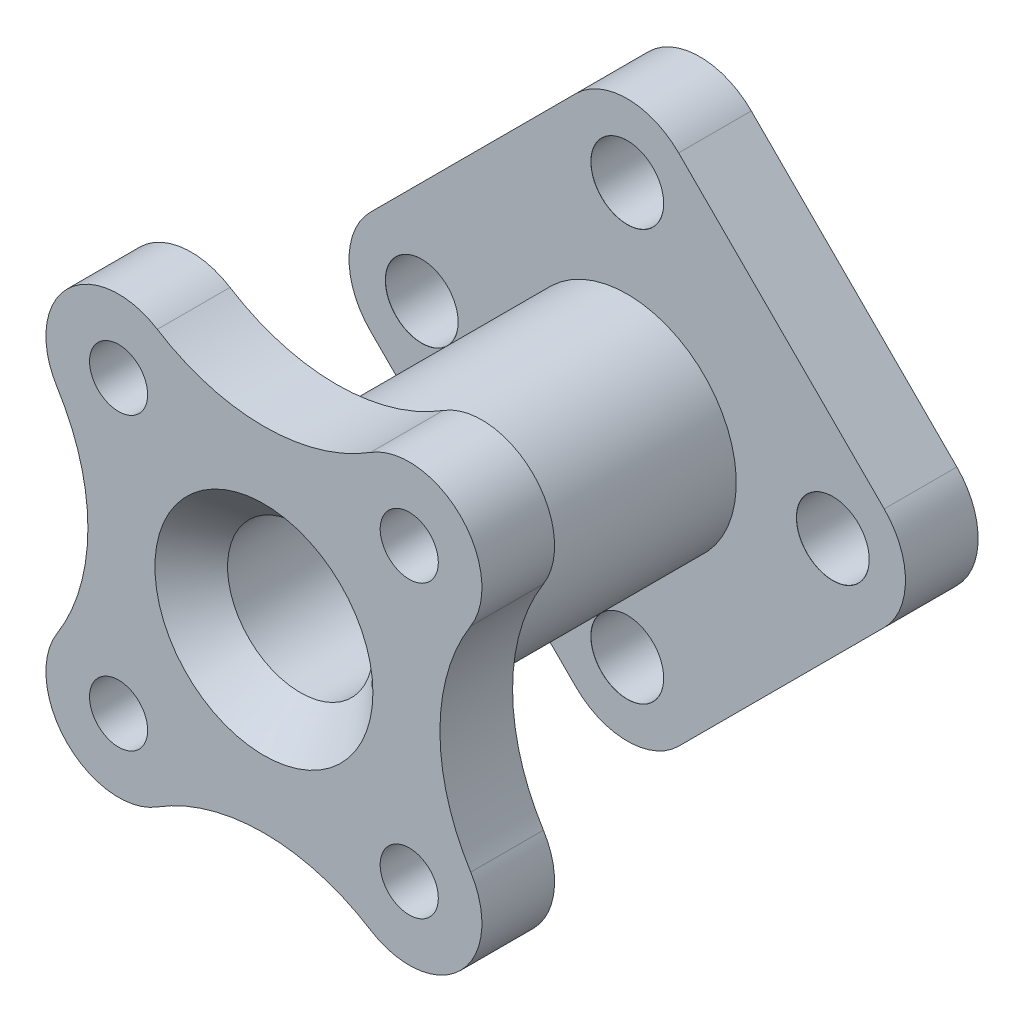
ISO-10303-21;
HEADER;
FILE_DESCRIPTION(('STEP AP214'),'2;1');
FILE_NAME('part.step','',(''),(''),'','','');
FILE_SCHEMA(('AUTOMOTIVE_DESIGN { 1 0 10303 214 1 1 1 1 }'));
ENDSEC;
DATA;
#1=APPLICATION_CONTEXT('core data for automotive mechanical design processes');
#2=APPLICATION_PROTOCOL_DEFINITION('international standard','automotive_design',2000,#1);
#3=PRODUCT_CONTEXT('',#1,'mechanical');
#4=PRODUCT('Part','Part','',(#3));
#5=PRODUCT_RELATED_PRODUCT_CATEGORY('part','',(#4));
#6=PRODUCT_DEFINITION_FORMATION('','',#4);
#7=PRODUCT_DEFINITION_CONTEXT('part definition',#1,'design');
#8=PRODUCT_DEFINITION('design','',#6,#7);
#9=PRODUCT_DEFINITION_SHAPE('','',#8);
#10=(LENGTH_UNIT() NAMED_UNIT(*) SI_UNIT(.MILLI.,.METRE.));
#11=(NAMED_UNIT(*) PLANE_ANGLE_UNIT() SI_UNIT($,.RADIAN.));
#12=(NAMED_UNIT(*) SI_UNIT($,.STERADIAN.) SOLID_ANGLE_UNIT());
#13=UNCERTAINTY_MEASURE_WITH_UNIT(LENGTH_MEASURE(1.E-05),#10,'distance_accuracy_value','');
#14=(GEOMETRIC_REPRESENTATION_CONTEXT(3) GLOBAL_UNCERTAINTY_ASSIGNED_CONTEXT((#13)) GLOBAL_UNIT_ASSIGNED_CONTEXT((#10,
#11,#12)) REPRESENTATION_CONTEXT('',''));
#15=CARTESIAN_POINT('',(0.,0.,0.));
#16=DIRECTION('',(0.,0.,1.));
#17=DIRECTION('',(1.,0.,0.));
#18=AXIS2_PLACEMENT_3D('',#15,#16,#17);
#19=CARTESIAN_POINT('',(0.,0.,20.));
#20=DIRECTION('',(0.,0.,1.));
#21=DIRECTION('',(1.,0.,0.));
#22=AXIS2_PLACEMENT_3D('',#19,#20,#21);
#23=PLANE('',#22);
#24=CARTESIAN_POINT('',(0.,0.,20.));
#25=DIRECTION('',(0.,0.,-1.));
#26=DIRECTION('',(1.,0.,0.));
#27=AXIS2_PLACEMENT_3D('',#24,#25,#26);
#28=CIRCLE('',#27,20.);
#29=CARTESIAN_POINT('',(-20.,0.,20.));
#30=VERTEX_POINT('',#29);
#31=EDGE_CURVE('E212',#30,#30,#28,.T.);
#32=ORIENTED_EDGE('',*,*,#31,.F.);
#33=EDGE_LOOP('',(#32));
#34=FACE_BOUND('',#33,.T.);
#35=ADVANCED_FACE('F14',(#34),#23,.T.);
#36=CARTESIAN_POINT('',(0.,56.5685424949238,20.));
#37=DIRECTION('',(0.,0.,1.));
#38=DIRECTION('',(-1.,0.,0.));
#39=AXIS2_PLACEMENT_3D('',#36,#37,#38);
#40=CYLINDRICAL_SURFACE('',#39,20.);
#41=CARTESIAN_POINT('',(0.,56.5685424949238,20.));
#42=DIRECTION('',(0.,0.,1.));
#43=DIRECTION('',(1.,0.,0.));
#44=AXIS2_PLACEMENT_3D('',#41,#42,#43);
#45=CIRCLE('',#44,20.);
#46=CARTESIAN_POINT('',(14.1421356237309,70.7106781186548,20.));
#47=VERTEX_POINT('',#46);
#48=CARTESIAN_POINT('',(-14.142135623731,70.7106781186548,20.));
#49=VERTEX_POINT('',#48);
#50=EDGE_CURVE('E199',#47,#49,#45,.T.);
#51=ORIENTED_EDGE('',*,*,#50,.F.);
#52=DIRECTION('',(0.,0.,1.));
#53=VECTOR('',#52,1.);
#54=CARTESIAN_POINT('',(14.1421356237309,70.7106781186548,20.));
#55=LINE('',#54,#53);
#56=CARTESIAN_POINT('',(14.1421356237309,70.7106781186548,0.));
#57=VERTEX_POINT('',#56);
#58=EDGE_CURVE('E228',#57,#47,#55,.T.);
#59=ORIENTED_EDGE('',*,*,#58,.F.);
#60=CARTESIAN_POINT('',(0.,56.5685424949238,0.));
#61=DIRECTION('',(0.,0.,-1.));
#62=DIRECTION('',(1.,0.,0.));
#63=AXIS2_PLACEMENT_3D('',#60,#61,#62);
#64=CIRCLE('',#63,20.);
#65=CARTESIAN_POINT('',(-14.142135623731,70.7106781186548,0.));
#66=VERTEX_POINT('',#65);
#67=EDGE_CURVE('E204',#66,#57,#64,.T.);
#68=ORIENTED_EDGE('',*,*,#67,.F.);
#69=DIRECTION('',(0.,0.,-1.));
#70=VECTOR('',#69,1.);
#71=CARTESIAN_POINT('',(-14.142135623731,70.7106781186548,20.));
#72=LINE('',#71,#70);
#73=EDGE_CURVE('E254',#49,#66,#72,.T.);
#74=ORIENTED_EDGE('',*,*,#73,.F.);
#75=EDGE_LOOP('',(#51,#59,#68,#74));
#76=FACE_BOUND('',#75,.T.);
#77=ADVANCED_FACE('F416',(#76),#40,.T.);
#78=CARTESIAN_POINT('',(0.,-56.5685424949238,20.));
#79=DIRECTION('',(0.,0.,1.));
#80=DIRECTION('',(-1.,0.,0.));
#81=AXIS2_PLACEMENT_3D('',#78,#79,#80);
#82=CYLINDRICAL_SURFACE('',#81,20.);
#83=CARTESIAN_POINT('',(0.,-56.5685424949238,20.));
#84=DIRECTION('',(0.,0.,1.));
#85=DIRECTION('',(1.,0.,0.));
#86=AXIS2_PLACEMENT_3D('',#83,#84,#85);
#87=CIRCLE('',#86,20.);
#88=CARTESIAN_POINT('',(-14.1421356237309,-70.7106781186548,20.));
#89=VERTEX_POINT('',#88);
#90=CARTESIAN_POINT('',(14.142135623731,-70.7106781186548,20.));
#91=VERTEX_POINT('',#90);
#92=EDGE_CURVE('E202',#89,#91,#87,.T.);
#93=ORIENTED_EDGE('',*,*,#92,.F.);
#94=DIRECTION('',(0.,0.,1.));
#95=VECTOR('',#94,1.);
#96=CARTESIAN_POINT('',(-14.1421356237309,-70.7106781186548,20.));
#97=LINE('',#96,#95);
#98=CARTESIAN_POINT('',(-14.1421356237309,-70.7106781186548,0.));
#99=VERTEX_POINT('',#98);
#100=EDGE_CURVE('E272',#99,#89,#97,.T.);
#101=ORIENTED_EDGE('',*,*,#100,.F.);
#102=CARTESIAN_POINT('',(0.,-56.5685424949238,0.));
#103=DIRECTION('',(0.,0.,-1.));
#104=DIRECTION('',(1.,0.,0.));
#105=AXIS2_PLACEMENT_3D('',#102,#103,#104);
#106=CIRCLE('',#105,20.);
#107=CARTESIAN_POINT('',(14.142135623731,-70.7106781186548,0.));
#108=VERTEX_POINT('',#107);
#109=EDGE_CURVE('E207',#108,#99,#106,.T.);
#110=ORIENTED_EDGE('',*,*,#109,.F.);
#111=DIRECTION('',(0.,0.,-1.));
#112=VECTOR('',#111,1.);
#113=CARTESIAN_POINT('',(14.142135623731,-70.7106781186548,20.));
#114=LINE('',#113,#112);
#115=EDGE_CURVE('E280',#91,#108,#114,.T.);
#116=ORIENTED_EDGE('',*,*,#115,.F.);
#117=EDGE_LOOP('',(#93,#101,#110,#116));
#118=FACE_BOUND('',#117,.T.);
#119=ADVANCED_FACE('F332',(#118),#82,.T.);
#120=CARTESIAN_POINT('',(56.5685424949238,0.,20.));
#121=DIRECTION('',(0.,0.,1.));
#122=DIRECTION('',(-1.,0.,0.));
#123=AXIS2_PLACEMENT_3D('',#120,#121,#122);
#124=CYLINDRICAL_SURFACE('',#123,20.);
#125=CARTESIAN_POINT('',(56.5685424949238,0.,20.));
#126=DIRECTION('',(0.,0.,1.));
#127=DIRECTION('',(1.,0.,0.));
#128=AXIS2_PLACEMENT_3D('',#125,#126,#127);
#129=CIRCLE('',#128,20.);
#130=CARTESIAN_POINT('',(70.7106781186548,-14.142135623731,20.));
#131=VERTEX_POINT('',#130);
#132=CARTESIAN_POINT('',(70.7106781186548,14.1421356237309,20.));
#133=VERTEX_POINT('',#132);
#134=EDGE_CURVE('E203',#131,#133,#129,.T.);
#135=ORIENTED_EDGE('',*,*,#134,.F.);
#136=DIRECTION('',(0.,0.,1.));
#137=VECTOR('',#136,1.);
#138=CARTESIAN_POINT('',(70.7106781186548,-14.142135623731,20.));
#139=LINE('',#138,#137);
#140=CARTESIAN_POINT('',(70.7106781186548,-14.142135623731,0.));
#141=VERTEX_POINT('',#140);
#142=EDGE_CURVE('E221',#141,#131,#139,.T.);
#143=ORIENTED_EDGE('',*,*,#142,.F.);
#144=CARTESIAN_POINT('',(56.5685424949238,0.,0.));
#145=DIRECTION('',(0.,0.,-1.));
#146=DIRECTION('',(1.,0.,0.));
#147=AXIS2_PLACEMENT_3D('',#144,#145,#146);
#148=CIRCLE('',#147,20.);
#149=CARTESIAN_POINT('',(70.7106781186548,14.1421356237309,0.));
#150=VERTEX_POINT('',#149);
#151=EDGE_CURVE('E241',#150,#141,#148,.T.);
#152=ORIENTED_EDGE('',*,*,#151,.F.);
#153=DIRECTION('',(0.,0.,-1.));
#154=VECTOR('',#153,1.);
#155=CARTESIAN_POINT('',(70.7106781186548,14.1421356237309,20.));
#156=LINE('',#155,#154);
#157=EDGE_CURVE('E268',#133,#150,#156,.T.);
#158=ORIENTED_EDGE('',*,*,#157,.F.);
#159=EDGE_LOOP('',(#135,#143,#152,#158));
#160=FACE_BOUND('',#159,.T.);
#161=ADVANCED_FACE('F441',(#160),#124,.T.);
#162=CARTESIAN_POINT('',(20.,71.7214438511238,100.));
#163=DIRECTION('',(0.,0.,1.));
#164=DIRECTION('',(1.,0.,0.));
#165=AXIS2_PLACEMENT_3D('',#162,#163,#164);
#166=PLANE('',#165);
#167=CARTESIAN_POINT('',(0.,103.442887702248,100.));
#168=DIRECTION('',(0.,0.,-1.));
#169=DIRECTION('',(1.,0.,0.));
#170=AXIS2_PLACEMENT_3D('',#167,#168,#169);
#171=CIRCLE('',#170,55.);
#172=CARTESIAN_POINT('',(29.3333333333333,56.918103387266,100.));
#173=VERTEX_POINT('',#172);
#174=CARTESIAN_POINT('',(-29.3333333333333,56.918103387266,100.));
#175=VERTEX_POINT('',#174);
#176=EDGE_CURVE('E206',#173,#175,#171,.T.);
#177=ORIENTED_EDGE('',*,*,#176,.F.);
#178=CARTESIAN_POINT('',(40.,40.,100.));
#179=DIRECTION('',(0.,0.,1.));
#180=DIRECTION('',(-1.,0.,0.));
#181=AXIS2_PLACEMENT_3D('',#178,#179,#180);
#182=CIRCLE('',#181,20.);
#183=CARTESIAN_POINT('',(56.918103387266,29.3333333333333,100.));
#184=VERTEX_POINT('',#183);
#185=EDGE_CURVE('E24',#184,#173,#182,.T.);
#186=ORIENTED_EDGE('',*,*,#185,.F.);
#187=CARTESIAN_POINT('',(103.442887702248,0.,100.));
#188=DIRECTION('',(0.,0.,-1.));
#189=DIRECTION('',(1.,0.,0.));
#190=AXIS2_PLACEMENT_3D('',#187,#188,#189);
#191=CIRCLE('',#190,55.);
#192=CARTESIAN_POINT('',(56.918103387266,-29.3333333333333,100.));
#193=VERTEX_POINT('',#192);
#194=EDGE_CURVE('E233',#193,#184,#191,.T.);
#195=ORIENTED_EDGE('',*,*,#194,.F.);
#196=CARTESIAN_POINT('',(40.,-40.,100.));
#197=DIRECTION('',(0.,0.,1.));
#198=DIRECTION('',(1.,0.,0.));
#199=AXIS2_PLACEMENT_3D('',#196,#197,#198);
#200=CIRCLE('',#199,20.);
#201=CARTESIAN_POINT('',(29.3333333333333,-56.918103387266,100.));
#202=VERTEX_POINT('',#201);
#203=EDGE_CURVE('E239',#202,#193,#200,.T.);
#204=ORIENTED_EDGE('',*,*,#203,.F.);
#205=CARTESIAN_POINT('',(0.,-103.442887702248,100.));
#206=DIRECTION('',(0.,0.,-1.));
#207=DIRECTION('',(-1.,0.,0.));
#208=AXIS2_PLACEMENT_3D('',#205,#206,#207);
#209=CIRCLE('',#208,55.);
#210=CARTESIAN_POINT('',(-29.3333333333333,-56.918103387266,100.));
#211=VERTEX_POINT('',#210);
#212=EDGE_CURVE('E102',#211,#202,#209,.T.);
#213=ORIENTED_EDGE('',*,*,#212,.F.);
#214=CARTESIAN_POINT('',(-40.,-40.,100.));
#215=DIRECTION('',(0.,0.,1.));
#216=DIRECTION('',(-1.,0.,0.));
#217=AXIS2_PLACEMENT_3D('',#214,#215,#216);
#218=CIRCLE('',#217,20.);
#219=CARTESIAN_POINT('',(-56.918103387266,-29.3333333333333,100.));
#220=VERTEX_POINT('',#219);
#221=EDGE_CURVE('E315',#220,#211,#218,.T.);
#222=ORIENTED_EDGE('',*,*,#221,.F.);
#223=CARTESIAN_POINT('',(-103.442887702248,0.,100.));
#224=DIRECTION('',(0.,0.,-1.));
#225=DIRECTION('',(-1.,0.,0.));
#226=AXIS2_PLACEMENT_3D('',#223,#224,#225);
#227=CIRCLE('',#226,55.);
#228=CARTESIAN_POINT('',(-56.918103387266,29.3333333333333,100.));
#229=VERTEX_POINT('',#228);
#230=EDGE_CURVE('E242',#229,#220,#227,.T.);
#231=ORIENTED_EDGE('',*,*,#230,.F.);
#232=CARTESIAN_POINT('',(-40.,40.,100.));
#233=DIRECTION('',(0.,0.,1.));
#234=DIRECTION('',(1.,0.,0.));
#235=AXIS2_PLACEMENT_3D('',#232,#233,#234);
#236=CIRCLE('',#235,20.);
#237=EDGE_CURVE('E293',#175,#229,#236,.T.);
#238=ORIENTED_EDGE('',*,*,#237,.F.);
#239=EDGE_LOOP('',(#177,#186,#195,#204,#213,#222,#231,#238));
#240=FACE_BOUND('',#239,.T.);
#241=CARTESIAN_POINT('',(0.,0.,100.));
#242=DIRECTION('',(0.,0.,1.));
#243=DIRECTION('',(1.,0.,0.));
#244=AXIS2_PLACEMENT_3D('',#241,#242,#243);
#245=CIRCLE('',#244,30.);
#246=CARTESIAN_POINT('',(-30.,0.,100.));
#247=VERTEX_POINT('',#246);
#248=EDGE_CURVE('E261',#247,#247,#245,.T.);
#249=ORIENTED_EDGE('',*,*,#248,.T.);
#250=EDGE_LOOP('',(#249));
#251=FACE_BOUND('',#250,.T.);
#252=CARTESIAN_POINT('',(40.,40.,100.));
#253=DIRECTION('',(0.,0.,1.));
#254=DIRECTION('',(1.,0.,0.));
#255=AXIS2_PLACEMENT_3D('',#252,#253,#254);
#256=CIRCLE('',#255,8.);
#257=CARTESIAN_POINT('',(48.,40.,100.));
#258=VERTEX_POINT('',#257);
#259=EDGE_CURVE('E363',#258,#258,#256,.T.);
#260=ORIENTED_EDGE('',*,*,#259,.T.);
#261=EDGE_LOOP('',(#260));
#262=FACE_BOUND('',#261,.T.);
#263=CARTESIAN_POINT('',(-40.,40.,100.));
#264=DIRECTION('',(0.,0.,1.));
#265=DIRECTION('',(1.,0.,0.));
#266=AXIS2_PLACEMENT_3D('',#263,#264,#265);
#267=CIRCLE('',#266,8.);
#268=CARTESIAN_POINT('',(-32.,40.,100.));
#269=VERTEX_POINT('',#268);
#270=EDGE_CURVE('E273',#269,#269,#267,.T.);
#271=ORIENTED_EDGE('',*,*,#270,.T.);
#272=EDGE_LOOP('',(#271));
#273=FACE_BOUND('',#272,.T.);
#274=CARTESIAN_POINT('',(-40.,-40.,100.));
#275=DIRECTION('',(0.,0.,1.));
#276=DIRECTION('',(1.,0.,0.));
#277=AXIS2_PLACEMENT_3D('',#274,#275,#276);
#278=CIRCLE('',#277,8.);
#279=CARTESIAN_POINT('',(-32.,-40.,100.));
#280=VERTEX_POINT('',#279);
#281=EDGE_CURVE('E285',#280,#280,#278,.T.);
#282=ORIENTED_EDGE('',*,*,#281,.T.);
#283=EDGE_LOOP('',(#282));
#284=FACE_BOUND('',#283,.T.);
#285=CARTESIAN_POINT('',(40.,-40.,100.));
#286=DIRECTION('',(0.,0.,1.));
#287=DIRECTION('',(1.,0.,0.));
#288=AXIS2_PLACEMENT_3D('',#285,#286,#287);
#289=CIRCLE('',#288,8.);
#290=CARTESIAN_POINT('',(48.,-40.,100.));
#291=VERTEX_POINT('',#290);
#292=EDGE_CURVE('E295',#291,#291,#289,.T.);
#293=ORIENTED_EDGE('',*,*,#292,.T.);
#294=EDGE_LOOP('',(#293));
#295=FACE_BOUND('',#294,.T.);
#296=ADVANCED_FACE('F437',(#240,#251,#262,#273,#284,#295),#166,.F.);
#297=CARTESIAN_POINT('',(20.,71.7214438511238,120.));
#298=DIRECTION('',(0.,0.,1.));
#299=DIRECTION('',(1.,0.,0.));
#300=AXIS2_PLACEMENT_3D('',#297,#298,#299);
#301=PLANE('',#300);
#302=CARTESIAN_POINT('',(0.,103.442887702248,120.));
#303=DIRECTION('',(0.,0.,-1.));
#304=DIRECTION('',(1.,0.,0.));
#305=AXIS2_PLACEMENT_3D('',#302,#303,#304);
#306=CIRCLE('',#305,55.);
#307=CARTESIAN_POINT('',(29.3333333333333,56.918103387266,120.));
#308=VERTEX_POINT('',#307);
#309=CARTESIAN_POINT('',(-29.3333333333333,56.918103387266,120.));
#310=VERTEX_POINT('',#309);
#311=EDGE_CURVE('E91',#308,#310,#306,.T.);
#312=ORIENTED_EDGE('',*,*,#311,.T.);
#313=CARTESIAN_POINT('',(-40.,40.,120.));
#314=DIRECTION('',(0.,0.,1.));
#315=DIRECTION('',(1.,0.,0.));
#316=AXIS2_PLACEMENT_3D('',#313,#314,#315);
#317=CIRCLE('',#316,20.);
#318=CARTESIAN_POINT('',(-56.918103387266,29.3333333333333,120.));
#319=VERTEX_POINT('',#318);
#320=EDGE_CURVE('E255',#310,#319,#317,.T.);
#321=ORIENTED_EDGE('',*,*,#320,.T.);
#322=CARTESIAN_POINT('',(-103.442887702248,0.,120.));
#323=DIRECTION('',(0.,0.,-1.));
#324=DIRECTION('',(-1.,0.,0.));
#325=AXIS2_PLACEMENT_3D('',#322,#323,#324);
#326=CIRCLE('',#325,55.);
#327=CARTESIAN_POINT('',(-56.918103387266,-29.3333333333333,120.));
#328=VERTEX_POINT('',#327);
#329=EDGE_CURVE('E244',#319,#328,#326,.T.);
#330=ORIENTED_EDGE('',*,*,#329,.T.);
#331=CARTESIAN_POINT('',(-40.,-40.,120.));
#332=DIRECTION('',(0.,0.,1.));
#333=DIRECTION('',(-1.,0.,0.));
#334=AXIS2_PLACEMENT_3D('',#331,#332,#333);
#335=CIRCLE('',#334,20.);
#336=CARTESIAN_POINT('',(-29.3333333333333,-56.918103387266,120.));
#337=VERTEX_POINT('',#336);
#338=EDGE_CURVE('E299',#328,#337,#335,.T.);
#339=ORIENTED_EDGE('',*,*,#338,.T.);
#340=CARTESIAN_POINT('',(0.,-103.442887702248,120.));
#341=DIRECTION('',(0.,0.,-1.));
#342=DIRECTION('',(-1.,0.,0.));
#343=AXIS2_PLACEMENT_3D('',#340,#341,#342);
#344=CIRCLE('',#343,55.);
#345=CARTESIAN_POINT('',(29.3333333333333,-56.918103387266,120.));
#346=VERTEX_POINT('',#345);
#347=EDGE_CURVE('E288',#337,#346,#344,.T.);
#348=ORIENTED_EDGE('',*,*,#347,.T.);
#349=CARTESIAN_POINT('',(40.,-40.,120.));
#350=DIRECTION('',(0.,0.,1.));
#351=DIRECTION('',(1.,0.,0.));
#352=AXIS2_PLACEMENT_3D('',#349,#350,#351);
#353=CIRCLE('',#352,20.);
#354=CARTESIAN_POINT('',(56.918103387266,-29.3333333333333,120.));
#355=VERTEX_POINT('',#354);
#356=EDGE_CURVE('E33',#346,#355,#353,.T.);
#357=ORIENTED_EDGE('',*,*,#356,.T.);
#358=CARTESIAN_POINT('',(103.442887702248,0.,120.));
#359=DIRECTION('',(0.,0.,-1.));
#360=DIRECTION('',(1.,0.,0.));
#361=AXIS2_PLACEMENT_3D('',#358,#359,#360);
#362=CIRCLE('',#361,55.);
#363=CARTESIAN_POINT('',(56.918103387266,29.3333333333333,120.));
#364=VERTEX_POINT('',#363);
#365=EDGE_CURVE('E18',#355,#364,#362,.T.);
#366=ORIENTED_EDGE('',*,*,#365,.T.);
#367=CARTESIAN_POINT('',(40.,40.,120.));
#368=DIRECTION('',(0.,0.,1.));
#369=DIRECTION('',(-1.,0.,0.));
#370=AXIS2_PLACEMENT_3D('',#367,#368,#369);
#371=CIRCLE('',#370,20.);
#372=EDGE_CURVE('E9',#364,#308,#371,.T.);
#373=ORIENTED_EDGE('',*,*,#372,.T.);
#374=EDGE_LOOP('',(#312,#321,#330,#339,#348,#357,#366,#373));
#375=FACE_BOUND('',#374,.T.);
#376=CARTESIAN_POINT('',(40.,40.,120.));
#377=DIRECTION('',(0.,0.,1.));
#378=DIRECTION('',(1.,0.,0.));
#379=AXIS2_PLACEMENT_3D('',#376,#377,#378);
#380=CIRCLE('',#379,8.);
#381=CARTESIAN_POINT('',(48.,40.,120.));
#382=VERTEX_POINT('',#381);
#383=EDGE_CURVE('E275',#382,#382,#380,.T.);
#384=ORIENTED_EDGE('',*,*,#383,.F.);
#385=EDGE_LOOP('',(#384));
#386=FACE_BOUND('',#385,.T.);
#387=CARTESIAN_POINT('',(-40.,40.,120.));
#388=DIRECTION('',(0.,0.,1.));
#389=DIRECTION('',(1.,0.,0.));
#390=AXIS2_PLACEMENT_3D('',#387,#388,#389);
#391=CIRCLE('',#390,8.);
#392=CARTESIAN_POINT('',(-32.,40.,120.));
#393=VERTEX_POINT('',#392);
#394=EDGE_CURVE('E276',#393,#393,#391,.T.);
#395=ORIENTED_EDGE('',*,*,#394,.F.);
#396=EDGE_LOOP('',(#395));
#397=FACE_BOUND('',#396,.T.);
#398=CARTESIAN_POINT('',(-40.,-40.,120.));
#399=DIRECTION('',(0.,0.,1.));
#400=DIRECTION('',(1.,0.,0.));
#401=AXIS2_PLACEMENT_3D('',#398,#399,#400);
#402=CIRCLE('',#401,8.);
#403=CARTESIAN_POINT('',(-32.,-40.,120.));
#404=VERTEX_POINT('',#403);
#405=EDGE_CURVE('E297',#404,#404,#402,.T.);
#406=ORIENTED_EDGE('',*,*,#405,.F.);
#407=EDGE_LOOP('',(#406));
#408=FACE_BOUND('',#407,.T.);
#409=CARTESIAN_POINT('',(40.,-40.,120.));
#410=DIRECTION('',(0.,0.,1.));
#411=DIRECTION('',(1.,0.,0.));
#412=AXIS2_PLACEMENT_3D('',#409,#410,#411);
#413=CIRCLE('',#412,8.);
#414=CARTESIAN_POINT('',(48.,-40.,120.));
#415=VERTEX_POINT('',#414);
#416=EDGE_CURVE('E226',#415,#415,#413,.T.);
#417=ORIENTED_EDGE('',*,*,#416,.F.);
#418=EDGE_LOOP('',(#417));
#419=FACE_BOUND('',#418,.T.);
#420=CARTESIAN_POINT('',(0.,0.,120.));
#421=DIRECTION('',(0.,0.,-1.));
#422=DIRECTION('',(1.,0.,0.));
#423=AXIS2_PLACEMENT_3D('',#420,#421,#422);
#424=CIRCLE('',#423,30.);
#425=CARTESIAN_POINT('',(30.,0.,120.));
#426=VERTEX_POINT('',#425);
#427=EDGE_CURVE('E213',#426,#426,#424,.T.);
#428=ORIENTED_EDGE('',*,*,#427,.T.);
#429=EDGE_LOOP('',(#428));
#430=FACE_BOUND('',#429,.T.);
#431=ADVANCED_FACE('F440',(#375,#386,#397,#408,#419,#430),#301,.T.);
#432=CARTESIAN_POINT('',(40.,40.,120.));
#433=DIRECTION('',(0.,0.,1.));
#434=DIRECTION('',(-1.,0.,0.));
#435=AXIS2_PLACEMENT_3D('',#432,#433,#434);
#436=CYLINDRICAL_SURFACE('',#435,20.);
#437=ORIENTED_EDGE('',*,*,#185,.T.);
#438=DIRECTION('',(0.,0.,-1.));
#439=VECTOR('',#438,1.);
#440=CARTESIAN_POINT('',(29.3333333333333,56.918103387266,120.));
#441=LINE('',#440,#439);
#442=EDGE_CURVE('E209',#308,#173,#441,.T.);
#443=ORIENTED_EDGE('',*,*,#442,.F.);
#444=ORIENTED_EDGE('',*,*,#372,.F.);
#445=DIRECTION('',(0.,0.,-1.));
#446=VECTOR('',#445,1.);
#447=CARTESIAN_POINT('',(56.918103387266,29.3333333333333,120.));
#448=LINE('',#447,#446);
#449=EDGE_CURVE('E236',#364,#184,#448,.T.);
#450=ORIENTED_EDGE('',*,*,#449,.T.);
#451=EDGE_LOOP('',(#437,#443,#444,#450));
#452=FACE_BOUND('',#451,.T.);
#453=ADVANCED_FACE('F16',(#452),#436,.T.);
#454=CARTESIAN_POINT('',(40.,-40.,120.));
#455=DIRECTION('',(0.,0.,1.));
#456=DIRECTION('',(-1.,0.,0.));
#457=AXIS2_PLACEMENT_3D('',#454,#455,#456);
#458=CYLINDRICAL_SURFACE('',#457,20.);
#459=ORIENTED_EDGE('',*,*,#203,.T.);
#460=DIRECTION('',(0.,0.,-1.));
#461=VECTOR('',#460,1.);
#462=CARTESIAN_POINT('',(56.918103387266,-29.3333333333333,120.));
#463=LINE('',#462,#461);
#464=EDGE_CURVE('E237',#355,#193,#463,.T.);
#465=ORIENTED_EDGE('',*,*,#464,.F.);
#466=ORIENTED_EDGE('',*,*,#356,.F.);
#467=DIRECTION('',(0.,0.,-1.));
#468=VECTOR('',#467,1.);
#469=CARTESIAN_POINT('',(29.3333333333333,-56.918103387266,120.));
#470=LINE('',#469,#468);
#471=EDGE_CURVE('E290',#346,#202,#470,.T.);
#472=ORIENTED_EDGE('',*,*,#471,.T.);
#473=EDGE_LOOP('',(#459,#465,#466,#472));
#474=FACE_BOUND('',#473,.T.);
#475=ADVANCED_FACE('F429',(#474),#458,.T.);
#476=CARTESIAN_POINT('',(0.,-103.442887702248,120.));
#477=DIRECTION('',(0.,0.,1.));
#478=DIRECTION('',(-1.,0.,0.));
#479=AXIS2_PLACEMENT_3D('',#476,#477,#478);
#480=CYLINDRICAL_SURFACE('',#479,55.);
#481=ORIENTED_EDGE('',*,*,#212,.T.);
#482=ORIENTED_EDGE('',*,*,#471,.F.);
#483=ORIENTED_EDGE('',*,*,#347,.F.);
#484=DIRECTION('',(0.,0.,-1.));
#485=VECTOR('',#484,1.);
#486=CARTESIAN_POINT('',(-29.3333333333333,-56.918103387266,120.));
#487=LINE('',#486,#485);
#488=EDGE_CURVE('E258',#337,#211,#487,.T.);
#489=ORIENTED_EDGE('',*,*,#488,.T.);
#490=EDGE_LOOP('',(#481,#482,#483,#489));
#491=FACE_BOUND('',#490,.T.);
#492=ADVANCED_FACE('F427',(#491),#480,.F.);
#493=CARTESIAN_POINT('',(-103.442887702248,0.,120.));
#494=DIRECTION('',(0.,0.,1.));
#495=DIRECTION('',(-1.,0.,0.));
#496=AXIS2_PLACEMENT_3D('',#493,#494,#495);
#497=CYLINDRICAL_SURFACE('',#496,55.);
#498=ORIENTED_EDGE('',*,*,#230,.T.);
#499=DIRECTION('',(0.,0.,-1.));
#500=VECTOR('',#499,1.);
#501=CARTESIAN_POINT('',(-56.918103387266,-29.3333333333333,120.));
#502=LINE('',#501,#500);
#503=EDGE_CURVE('E302',#328,#220,#502,.T.);
#504=ORIENTED_EDGE('',*,*,#503,.F.);
#505=ORIENTED_EDGE('',*,*,#329,.F.);
#506=DIRECTION('',(0.,0.,-1.));
#507=VECTOR('',#506,1.);
#508=CARTESIAN_POINT('',(-56.918103387266,29.3333333333333,120.));
#509=LINE('',#508,#507);
#510=EDGE_CURVE('E262',#319,#229,#509,.T.);
#511=ORIENTED_EDGE('',*,*,#510,.T.);
#512=EDGE_LOOP('',(#498,#504,#505,#511));
#513=FACE_BOUND('',#512,.T.);
#514=ADVANCED_FACE('F382',(#513),#497,.F.);
#515=CARTESIAN_POINT('',(0.,103.442887702248,120.));
#516=DIRECTION('',(0.,0.,1.));
#517=DIRECTION('',(-1.,0.,0.));
#518=AXIS2_PLACEMENT_3D('',#515,#516,#517);
#519=CYLINDRICAL_SURFACE('',#518,55.);
#520=ORIENTED_EDGE('',*,*,#176,.T.);
#521=DIRECTION('',(0.,0.,-1.));
#522=VECTOR('',#521,1.);
#523=CARTESIAN_POINT('',(-29.3333333333333,56.918103387266,120.));
#524=LINE('',#523,#522);
#525=EDGE_CURVE('E257',#310,#175,#524,.T.);
#526=ORIENTED_EDGE('',*,*,#525,.F.);
#527=ORIENTED_EDGE('',*,*,#311,.F.);
#528=ORIENTED_EDGE('',*,*,#442,.T.);
#529=EDGE_LOOP('',(#520,#526,#527,#528));
#530=FACE_BOUND('',#529,.T.);
#531=ADVANCED_FACE('F410',(#530),#519,.F.);
#532=CARTESIAN_POINT('',(0.,0.,0.));
#533=DIRECTION('',(0.,0.,1.));
#534=DIRECTION('',(1.,0.,0.));
#535=AXIS2_PLACEMENT_3D('',#532,#533,#534);
#536=PLANE('',#535);
#537=DIRECTION('',(-0.707106781186548,0.707106781186548,0.));
#538=VECTOR('',#537,1.);
#539=CARTESIAN_POINT('',(84.8528137423857,0.,0.));
#540=LINE('',#539,#538);
#541=EDGE_CURVE('E232',#150,#57,#540,.T.);
#542=ORIENTED_EDGE('',*,*,#541,.F.);
#543=ORIENTED_EDGE('',*,*,#151,.T.);
#544=DIRECTION('',(0.707106781186547,0.707106781186548,0.));
#545=VECTOR('',#544,1.);
#546=CARTESIAN_POINT('',(0.,-84.8528137423857,0.));
#547=LINE('',#546,#545);
#548=EDGE_CURVE('E218',#108,#141,#547,.T.);
#549=ORIENTED_EDGE('',*,*,#548,.F.);
#550=ORIENTED_EDGE('',*,*,#109,.T.);
#551=DIRECTION('',(0.707106781186548,-0.707106781186548,0.));
#552=VECTOR('',#551,1.);
#553=CARTESIAN_POINT('',(-84.8528137423857,0.,0.));
#554=LINE('',#553,#552);
#555=CARTESIAN_POINT('',(-70.7106781186548,-14.142135623731,0.));
#556=VERTEX_POINT('',#555);
#557=EDGE_CURVE('E269',#556,#99,#554,.T.);
#558=ORIENTED_EDGE('',*,*,#557,.F.);
#559=CARTESIAN_POINT('',(-56.5685424949238,0.,0.));
#560=DIRECTION('',(0.,0.,-1.));
#561=DIRECTION('',(1.,0.,0.));
#562=AXIS2_PLACEMENT_3D('',#559,#560,#561);
#563=CIRCLE('',#562,20.);
#564=CARTESIAN_POINT('',(-70.7106781186548,14.1421356237309,0.));
#565=VERTEX_POINT('',#564);
#566=EDGE_CURVE('E227',#556,#565,#563,.T.);
#567=ORIENTED_EDGE('',*,*,#566,.T.);
#568=DIRECTION('',(-0.707106781186547,-0.707106781186548,0.));
#569=VECTOR('',#568,1.);
#570=CARTESIAN_POINT('',(0.,84.8528137423857,0.));
#571=LINE('',#570,#569);
#572=EDGE_CURVE('E231',#66,#565,#571,.T.);
#573=ORIENTED_EDGE('',*,*,#572,.F.);
#574=ORIENTED_EDGE('',*,*,#67,.T.);
#575=EDGE_LOOP('',(#542,#543,#549,#550,#558,#567,#573,#574));
#576=FACE_BOUND('',#575,.T.);
#577=CARTESIAN_POINT('',(-56.5685424949238,0.,0.));
#578=DIRECTION('',(0.,0.,1.));
#579=DIRECTION('',(1.,0.,0.));
#580=AXIS2_PLACEMENT_3D('',#577,#578,#579);
#581=CIRCLE('',#580,10.);
#582=CARTESIAN_POINT('',(-46.5685424949238,0.,0.));
#583=VERTEX_POINT('',#582);
#584=EDGE_CURVE('E214',#583,#583,#581,.T.);
#585=ORIENTED_EDGE('',*,*,#584,.T.);
#586=EDGE_LOOP('',(#585));
#587=FACE_BOUND('',#586,.T.);
#588=CARTESIAN_POINT('',(0.,-56.5685424949238,0.));
#589=DIRECTION('',(0.,0.,1.));
#590=DIRECTION('',(1.,0.,0.));
#591=AXIS2_PLACEMENT_3D('',#588,#589,#590);
#592=CIRCLE('',#591,10.);
#593=CARTESIAN_POINT('',(10.,-56.5685424949238,0.));
#594=VERTEX_POINT('',#593);
#595=EDGE_CURVE('E190',#594,#594,#592,.T.);
#596=ORIENTED_EDGE('',*,*,#595,.T.);
#597=EDGE_LOOP('',(#596));
#598=FACE_BOUND('',#597,.T.);
#599=CARTESIAN_POINT('',(56.5685424949238,0.,0.));
#600=DIRECTION('',(0.,0.,1.));
#601=DIRECTION('',(1.,0.,0.));
#602=AXIS2_PLACEMENT_3D('',#599,#600,#601);
#603=CIRCLE('',#602,10.);
#604=CARTESIAN_POINT('',(66.5685424949238,0.,0.));
#605=VERTEX_POINT('',#604);
#606=EDGE_CURVE('E195',#605,#605,#603,.T.);
#607=ORIENTED_EDGE('',*,*,#606,.T.);
#608=EDGE_LOOP('',(#607));
#609=FACE_BOUND('',#608,.T.);
#610=CARTESIAN_POINT('',(0.,56.5685424949238,0.));
#611=DIRECTION('',(0.,0.,1.));
#612=DIRECTION('',(1.,0.,0.));
#613=AXIS2_PLACEMENT_3D('',#610,#611,#612);
#614=CIRCLE('',#613,10.);
#615=CARTESIAN_POINT('',(10.,56.5685424949238,0.));
#616=VERTEX_POINT('',#615);
#617=EDGE_CURVE('E248',#616,#616,#614,.T.);
#618=ORIENTED_EDGE('',*,*,#617,.T.);
#619=EDGE_LOOP('',(#618));
#620=FACE_BOUND('',#619,.T.);
#621=ADVANCED_FACE('F401',(#576,#587,#598,#609,#620),#536,.F.);
#622=CARTESIAN_POINT('',(0.,0.,20.));
#623=DIRECTION('',(0.,0.,1.));
#624=DIRECTION('',(1.,0.,0.));
#625=AXIS2_PLACEMENT_3D('',#622,#623,#624);
#626=PLANE('',#625);
#627=DIRECTION('',(0.707106781186547,0.707106781186548,0.));
#628=VECTOR('',#627,1.);
#629=CARTESIAN_POINT('',(0.,-84.8528137423857,20.));
#630=LINE('',#629,#628);
#631=EDGE_CURVE('E277',#91,#131,#630,.T.);
#632=ORIENTED_EDGE('',*,*,#631,.T.);
#633=ORIENTED_EDGE('',*,*,#134,.T.);
#634=DIRECTION('',(-0.707106781186548,0.707106781186548,0.));
#635=VECTOR('',#634,1.);
#636=CARTESIAN_POINT('',(84.8528137423857,0.,20.));
#637=LINE('',#636,#635);
#638=EDGE_CURVE('E265',#133,#47,#637,.T.);
#639=ORIENTED_EDGE('',*,*,#638,.T.);
#640=ORIENTED_EDGE('',*,*,#50,.T.);
#641=DIRECTION('',(-0.707106781186547,-0.707106781186548,0.));
#642=VECTOR('',#641,1.);
#643=CARTESIAN_POINT('',(0.,84.8528137423857,20.));
#644=LINE('',#643,#642);
#645=CARTESIAN_POINT('',(-70.7106781186548,14.1421356237309,20.));
#646=VERTEX_POINT('',#645);
#647=EDGE_CURVE('E252',#49,#646,#644,.T.);
#648=ORIENTED_EDGE('',*,*,#647,.T.);
#649=CARTESIAN_POINT('',(-56.5685424949238,0.,20.));
#650=DIRECTION('',(0.,0.,1.));
#651=DIRECTION('',(1.,0.,0.));
#652=AXIS2_PLACEMENT_3D('',#649,#650,#651);
#653=CIRCLE('',#652,20.);
#654=CARTESIAN_POINT('',(-70.7106781186548,-14.142135623731,20.));
#655=VERTEX_POINT('',#654);
#656=EDGE_CURVE('E216',#646,#655,#653,.T.);
#657=ORIENTED_EDGE('',*,*,#656,.T.);
#658=DIRECTION('',(0.707106781186548,-0.707106781186548,0.));
#659=VECTOR('',#658,1.);
#660=CARTESIAN_POINT('',(-84.8528137423857,0.,20.));
#661=LINE('',#660,#659);
#662=EDGE_CURVE('E222',#655,#89,#661,.T.);
#663=ORIENTED_EDGE('',*,*,#662,.T.);
#664=ORIENTED_EDGE('',*,*,#92,.T.);
#665=EDGE_LOOP('',(#632,#633,#639,#640,#648,#657,#663,#664));
#666=FACE_BOUND('',#665,.T.);
#667=CARTESIAN_POINT('',(0.,0.,20.));
#668=DIRECTION('',(0.,0.,1.));
#669=DIRECTION('',(1.,0.,0.));
#670=AXIS2_PLACEMENT_3D('',#667,#668,#669);
#671=CIRCLE('',#670,30.);
#672=CARTESIAN_POINT('',(-30.,0.,20.));
#673=VERTEX_POINT('',#672);
#674=EDGE_CURVE('E259',#673,#673,#671,.T.);
#675=ORIENTED_EDGE('',*,*,#674,.F.);
#676=EDGE_LOOP('',(#675));
#677=FACE_BOUND('',#676,.T.);
#678=CARTESIAN_POINT('',(-56.5685424949238,0.,20.));
#679=DIRECTION('',(0.,0.,1.));
#680=DIRECTION('',(1.,0.,0.));
#681=AXIS2_PLACEMENT_3D('',#678,#679,#680);
#682=CIRCLE('',#681,10.025);
#683=CARTESIAN_POINT('',(-46.5435424949238,0.,20.));
#684=VERTEX_POINT('',#683);
#685=EDGE_CURVE('E193',#684,#684,#682,.T.);
#686=ORIENTED_EDGE('',*,*,#685,.F.);
#687=EDGE_LOOP('',(#686));
#688=FACE_BOUND('',#687,.T.);
#689=CARTESIAN_POINT('',(0.,-56.5685424949238,20.));
#690=DIRECTION('',(0.,0.,1.));
#691=DIRECTION('',(1.,0.,0.));
#692=AXIS2_PLACEMENT_3D('',#689,#690,#691);
#693=CIRCLE('',#692,10.025);
#694=CARTESIAN_POINT('',(10.025,-56.5685424949238,20.));
#695=VERTEX_POINT('',#694);
#696=EDGE_CURVE('E191',#695,#695,#693,.T.);
#697=ORIENTED_EDGE('',*,*,#696,.F.);
#698=EDGE_LOOP('',(#697));
#699=FACE_BOUND('',#698,.T.);
#700=CARTESIAN_POINT('',(56.5685424949238,0.,20.));
#701=DIRECTION('',(0.,0.,1.));
#702=DIRECTION('',(1.,0.,0.));
#703=AXIS2_PLACEMENT_3D('',#700,#701,#702);
#704=CIRCLE('',#703,10.025);
#705=CARTESIAN_POINT('',(66.5935424949238,0.,20.));
#706=VERTEX_POINT('',#705);
#707=EDGE_CURVE('E245',#706,#706,#704,.T.);
#708=ORIENTED_EDGE('',*,*,#707,.F.);
#709=EDGE_LOOP('',(#708));
#710=FACE_BOUND('',#709,.T.);
#711=CARTESIAN_POINT('',(0.,56.5685424949238,20.));
#712=DIRECTION('',(0.,0.,1.));
#713=DIRECTION('',(1.,0.,0.));
#714=AXIS2_PLACEMENT_3D('',#711,#712,#713);
#715=CIRCLE('',#714,10.025);
#716=CARTESIAN_POINT('',(10.025,56.5685424949238,20.));
#717=VERTEX_POINT('',#716);
#718=EDGE_CURVE('E312',#717,#717,#715,.T.);
#719=ORIENTED_EDGE('',*,*,#718,.F.);
#720=EDGE_LOOP('',(#719));
#721=FACE_BOUND('',#720,.T.);
#722=ADVANCED_FACE('F340',(#666,#677,#688,#699,#710,#721),#626,.T.);
#723=CARTESIAN_POINT('',(0.,-84.8528137423857,20.));
#724=DIRECTION('',(-0.707106781186548,0.707106781186547,0.));
#725=DIRECTION('',(-0.707106781186547,-0.707106781186548,0.));
#726=AXIS2_PLACEMENT_3D('',#723,#724,#725);
#727=PLANE('',#726);
#728=ORIENTED_EDGE('',*,*,#548,.T.);
#729=ORIENTED_EDGE('',*,*,#142,.T.);
#730=ORIENTED_EDGE('',*,*,#631,.F.);
#731=ORIENTED_EDGE('',*,*,#115,.T.);
#732=EDGE_LOOP('',(#728,#729,#730,#731));
#733=FACE_BOUND('',#732,.T.);
#734=ADVANCED_FACE('F400',(#733),#727,.F.);
#735=CARTESIAN_POINT('',(-84.8528137423857,0.,20.));
#736=DIRECTION('',(0.707106781186547,0.707106781186548,0.));
#737=DIRECTION('',(-0.707106781186548,0.707106781186548,0.));
#738=AXIS2_PLACEMENT_3D('',#735,#736,#737);
#739=PLANE('',#738);
#740=ORIENTED_EDGE('',*,*,#557,.T.);
#741=ORIENTED_EDGE('',*,*,#100,.T.);
#742=ORIENTED_EDGE('',*,*,#662,.F.);
#743=DIRECTION('',(0.,0.,-1.));
#744=VECTOR('',#743,1.);
#745=CARTESIAN_POINT('',(-70.7106781186548,-14.142135623731,20.));
#746=LINE('',#745,#744);
#747=EDGE_CURVE('E223',#655,#556,#746,.T.);
#748=ORIENTED_EDGE('',*,*,#747,.T.);
#749=EDGE_LOOP('',(#740,#741,#742,#748));
#750=FACE_BOUND('',#749,.T.);
#751=ADVANCED_FACE('F328',(#750),#739,.F.);
#752=CARTESIAN_POINT('',(0.,84.8528137423857,20.));
#753=DIRECTION('',(0.707106781186548,-0.707106781186547,0.));
#754=DIRECTION('',(0.707106781186547,0.707106781186548,0.));
#755=AXIS2_PLACEMENT_3D('',#752,#753,#754);
#756=PLANE('',#755);
#757=ORIENTED_EDGE('',*,*,#572,.T.);
#758=DIRECTION('',(0.,0.,1.));
#759=VECTOR('',#758,1.);
#760=CARTESIAN_POINT('',(-70.7106781186548,14.1421356237309,20.));
#761=LINE('',#760,#759);
#762=EDGE_CURVE('E251',#565,#646,#761,.T.);
#763=ORIENTED_EDGE('',*,*,#762,.T.);
#764=ORIENTED_EDGE('',*,*,#647,.F.);
#765=ORIENTED_EDGE('',*,*,#73,.T.);
#766=EDGE_LOOP('',(#757,#763,#764,#765));
#767=FACE_BOUND('',#766,.T.);
#768=ADVANCED_FACE('F432',(#767),#756,.F.);
#769=CARTESIAN_POINT('',(84.8528137423857,0.,20.));
#770=DIRECTION('',(-0.707106781186548,-0.707106781186548,0.));
#771=DIRECTION('',(0.707106781186548,-0.707106781186548,0.));
#772=AXIS2_PLACEMENT_3D('',#769,#770,#771);
#773=PLANE('',#772);
#774=ORIENTED_EDGE('',*,*,#638,.F.);
#775=ORIENTED_EDGE('',*,*,#157,.T.);
#776=ORIENTED_EDGE('',*,*,#541,.T.);
#777=ORIENTED_EDGE('',*,*,#58,.T.);
#778=EDGE_LOOP('',(#774,#775,#776,#777));
#779=FACE_BOUND('',#778,.T.);
#780=ADVANCED_FACE('F435',(#779),#773,.F.);
#781=CARTESIAN_POINT('',(0.,0.,100.));
#782=DIRECTION('',(0.,0.,1.));
#783=DIRECTION('',(-1.,0.,0.));
#784=AXIS2_PLACEMENT_3D('',#781,#782,#783);
#785=CYLINDRICAL_SURFACE('',#784,30.);
#786=ORIENTED_EDGE('',*,*,#248,.F.);
#787=EDGE_LOOP('',(#786));
#788=FACE_BOUND('',#787,.T.);
#789=ORIENTED_EDGE('',*,*,#674,.T.);
#790=EDGE_LOOP('',(#789));
#791=FACE_BOUND('',#790,.T.);
#792=ADVANCED_FACE('F457',(#788,#791),#785,.T.);
#793=CARTESIAN_POINT('',(-40.,40.,120.));
#794=DIRECTION('',(0.,0.,1.));
#795=DIRECTION('',(-1.,0.,0.));
#796=AXIS2_PLACEMENT_3D('',#793,#794,#795);
#797=CYLINDRICAL_SURFACE('',#796,20.);
#798=ORIENTED_EDGE('',*,*,#320,.F.);
#799=ORIENTED_EDGE('',*,*,#525,.T.);
#800=ORIENTED_EDGE('',*,*,#237,.T.);
#801=ORIENTED_EDGE('',*,*,#510,.F.);
#802=EDGE_LOOP('',(#798,#799,#800,#801));
#803=FACE_BOUND('',#802,.T.);
#804=ADVANCED_FACE('F460',(#803),#797,.T.);
#805=CARTESIAN_POINT('',(-40.,-40.,120.));
#806=DIRECTION('',(0.,0.,1.));
#807=DIRECTION('',(-1.,0.,0.));
#808=AXIS2_PLACEMENT_3D('',#805,#806,#807);
#809=CYLINDRICAL_SURFACE('',#808,20.);
#810=ORIENTED_EDGE('',*,*,#338,.F.);
#811=ORIENTED_EDGE('',*,*,#503,.T.);
#812=ORIENTED_EDGE('',*,*,#221,.T.);
#813=ORIENTED_EDGE('',*,*,#488,.F.);
#814=EDGE_LOOP('',(#810,#811,#812,#813));
#815=FACE_BOUND('',#814,.T.);
#816=ADVANCED_FACE('F379',(#815),#809,.T.);
#817=CARTESIAN_POINT('',(103.442887702248,0.,120.));
#818=DIRECTION('',(0.,0.,1.));
#819=DIRECTION('',(-1.,0.,0.));
#820=AXIS2_PLACEMENT_3D('',#817,#818,#819);
#821=CYLINDRICAL_SURFACE('',#820,55.);
#822=ORIENTED_EDGE('',*,*,#365,.F.);
#823=ORIENTED_EDGE('',*,*,#464,.T.);
#824=ORIENTED_EDGE('',*,*,#194,.T.);
#825=ORIENTED_EDGE('',*,*,#449,.F.);
#826=EDGE_LOOP('',(#822,#823,#824,#825));
#827=FACE_BOUND('',#826,.T.);
#828=ADVANCED_FACE('F462',(#827),#821,.F.);
#829=CARTESIAN_POINT('',(40.,40.,100.));
#830=DIRECTION('',(0.,0.,-1.));
#831=DIRECTION('',(1.,0.,0.));
#832=AXIS2_PLACEMENT_3D('',#829,#830,#831);
#833=CYLINDRICAL_SURFACE('',#832,8.);
#834=ORIENTED_EDGE('',*,*,#259,.F.);
#835=EDGE_LOOP('',(#834));
#836=FACE_BOUND('',#835,.T.);
#837=ORIENTED_EDGE('',*,*,#383,.T.);
#838=EDGE_LOOP('',(#837));
#839=FACE_BOUND('',#838,.T.);
#840=ADVANCED_FACE('F465',(#836,#839),#833,.F.);
#841=CARTESIAN_POINT('',(-40.,40.,100.));
#842=DIRECTION('',(0.,0.,-1.));
#843=DIRECTION('',(1.,0.,0.));
#844=AXIS2_PLACEMENT_3D('',#841,#842,#843);
#845=CYLINDRICAL_SURFACE('',#844,8.);
#846=ORIENTED_EDGE('',*,*,#270,.F.);
#847=EDGE_LOOP('',(#846));
#848=FACE_BOUND('',#847,.T.);
#849=ORIENTED_EDGE('',*,*,#394,.T.);
#850=EDGE_LOOP('',(#849));
#851=FACE_BOUND('',#850,.T.);
#852=ADVANCED_FACE('F450',(#848,#851),#845,.F.);
#853=CARTESIAN_POINT('',(-40.,-40.,100.));
#854=DIRECTION('',(0.,0.,-1.));
#855=DIRECTION('',(1.,0.,0.));
#856=AXIS2_PLACEMENT_3D('',#853,#854,#855);
#857=CYLINDRICAL_SURFACE('',#856,8.);
#858=ORIENTED_EDGE('',*,*,#281,.F.);
#859=EDGE_LOOP('',(#858));
#860=FACE_BOUND('',#859,.T.);
#861=ORIENTED_EDGE('',*,*,#405,.T.);
#862=EDGE_LOOP('',(#861));
#863=FACE_BOUND('',#862,.T.);
#864=ADVANCED_FACE('F447',(#860,#863),#857,.F.);
#865=CARTESIAN_POINT('',(40.,-40.,100.));
#866=DIRECTION('',(0.,0.,-1.));
#867=DIRECTION('',(1.,0.,0.));
#868=AXIS2_PLACEMENT_3D('',#865,#866,#867);
#869=CYLINDRICAL_SURFACE('',#868,8.);
#870=ORIENTED_EDGE('',*,*,#292,.F.);
#871=EDGE_LOOP('',(#870));
#872=FACE_BOUND('',#871,.T.);
#873=ORIENTED_EDGE('',*,*,#416,.T.);
#874=EDGE_LOOP('',(#873));
#875=FACE_BOUND('',#874,.T.);
#876=ADVANCED_FACE('F446',(#872,#875),#869,.F.);
#877=CARTESIAN_POINT('',(-56.5685424949238,0.,20.));
#878=DIRECTION('',(0.,0.,1.));
#879=DIRECTION('',(-1.,0.,0.));
#880=AXIS2_PLACEMENT_3D('',#877,#878,#879);
#881=CYLINDRICAL_SURFACE('',#880,20.);
#882=ORIENTED_EDGE('',*,*,#656,.F.);
#883=ORIENTED_EDGE('',*,*,#762,.F.);
#884=ORIENTED_EDGE('',*,*,#566,.F.);
#885=ORIENTED_EDGE('',*,*,#747,.F.);
#886=EDGE_LOOP('',(#882,#883,#884,#885));
#887=FACE_BOUND('',#886,.T.);
#888=ADVANCED_FACE('F442',(#887),#881,.T.);
#889=CARTESIAN_POINT('',(-56.5685424949238,0.,20.));
#890=DIRECTION('',(0.,0.,-1.));
#891=DIRECTION('',(1.,0.,0.));
#892=AXIS2_PLACEMENT_3D('',#889,#890,#891);
#893=CYLINDRICAL_SURFACE('',#892,10.);
#894=ORIENTED_EDGE('',*,*,#584,.F.);
#895=EDGE_LOOP('',(#894));
#896=FACE_BOUND('',#895,.T.);
#897=CARTESIAN_POINT('',(-56.5685424949238,0.,19.9790225092205));
#898=DIRECTION('',(0.,0.,1.));
#899=DIRECTION('',(1.,0.,0.));
#900=AXIS2_PLACEMENT_3D('',#897,#898,#899);
#901=CIRCLE('',#900,10.);
#902=CARTESIAN_POINT('',(-46.5685424949238,0.,19.9790225092205));
#903=VERTEX_POINT('',#902);
#904=EDGE_CURVE('E217',#903,#903,#901,.T.);
#905=ORIENTED_EDGE('',*,*,#904,.T.);
#906=EDGE_LOOP('',(#905));
#907=FACE_BOUND('',#906,.T.);
#908=ADVANCED_FACE('F445',(#896,#907),#893,.F.);
#909=CARTESIAN_POINT('',(-56.5685424949238,0.,20.));
#910=DIRECTION('',(0.,0.,1.));
#911=DIRECTION('',(1.,0.,0.));
#912=AXIS2_PLACEMENT_3D('',#909,#910,#911);
#913=CONICAL_SURFACE('',#912,10.025,0.872664625996927);
#914=ORIENTED_EDGE('',*,*,#904,.F.);
#915=EDGE_LOOP('',(#914));
#916=FACE_BOUND('',#915,.T.);
#917=ORIENTED_EDGE('',*,*,#685,.T.);
#918=EDGE_LOOP('',(#917));
#919=FACE_BOUND('',#918,.T.);
#920=ADVANCED_FACE('F560',(#916,#919),#913,.F.);
#921=CARTESIAN_POINT('',(0.,-56.5685424949238,20.));
#922=DIRECTION('',(0.,0.,-1.));
#923=DIRECTION('',(1.,0.,0.));
#924=AXIS2_PLACEMENT_3D('',#921,#922,#923);
#925=CYLINDRICAL_SURFACE('',#924,10.);
#926=ORIENTED_EDGE('',*,*,#595,.F.);
#927=EDGE_LOOP('',(#926));
#928=FACE_BOUND('',#927,.T.);
#929=CARTESIAN_POINT('',(0.,-56.5685424949238,19.9790225092205));
#930=DIRECTION('',(0.,0.,1.));
#931=DIRECTION('',(1.,0.,0.));
#932=AXIS2_PLACEMENT_3D('',#929,#930,#931);
#933=CIRCLE('',#932,10.);
#934=CARTESIAN_POINT('',(10.,-56.5685424949238,19.9790225092205));
#935=VERTEX_POINT('',#934);
#936=EDGE_CURVE('E187',#935,#935,#933,.T.);
#937=ORIENTED_EDGE('',*,*,#936,.T.);
#938=EDGE_LOOP('',(#937));
#939=FACE_BOUND('',#938,.T.);
#940=ADVANCED_FACE('F188',(#928,#939),#925,.F.);
#941=CARTESIAN_POINT('',(0.,-56.5685424949238,20.));
#942=DIRECTION('',(0.,0.,1.));
#943=DIRECTION('',(1.,0.,0.));
#944=AXIS2_PLACEMENT_3D('',#941,#942,#943);
#945=CONICAL_SURFACE('',#944,10.025,0.872664625996995);
#946=ORIENTED_EDGE('',*,*,#936,.F.);
#947=EDGE_LOOP('',(#946));
#948=FACE_BOUND('',#947,.T.);
#949=ORIENTED_EDGE('',*,*,#696,.T.);
#950=EDGE_LOOP('',(#949));
#951=FACE_BOUND('',#950,.T.);
#952=ADVANCED_FACE('F577',(#948,#951),#945,.F.);
#953=CARTESIAN_POINT('',(56.5685424949238,0.,20.));
#954=DIRECTION('',(0.,0.,-1.));
#955=DIRECTION('',(1.,0.,0.));
#956=AXIS2_PLACEMENT_3D('',#953,#954,#955);
#957=CYLINDRICAL_SURFACE('',#956,10.);
#958=ORIENTED_EDGE('',*,*,#606,.F.);
#959=EDGE_LOOP('',(#958));
#960=FACE_BOUND('',#959,.T.);
#961=CARTESIAN_POINT('',(56.5685424949238,0.,19.9790225092205));
#962=DIRECTION('',(0.,0.,1.));
#963=DIRECTION('',(1.,0.,0.));
#964=AXIS2_PLACEMENT_3D('',#961,#962,#963);
#965=CIRCLE('',#964,10.);
#966=CARTESIAN_POINT('',(66.5685424949238,0.,19.9790225092205));
#967=VERTEX_POINT('',#966);
#968=EDGE_CURVE('E247',#967,#967,#965,.T.);
#969=ORIENTED_EDGE('',*,*,#968,.T.);
#970=EDGE_LOOP('',(#969));
#971=FACE_BOUND('',#970,.T.);
#972=ADVANCED_FACE('F586',(#960,#971),#957,.F.);
#973=CARTESIAN_POINT('',(56.5685424949238,0.,20.));
#974=DIRECTION('',(0.,0.,1.));
#975=DIRECTION('',(1.,0.,0.));
#976=AXIS2_PLACEMENT_3D('',#973,#974,#975);
#977=CONICAL_SURFACE('',#976,10.025,0.872664625997201);
#978=ORIENTED_EDGE('',*,*,#968,.F.);
#979=EDGE_LOOP('',(#978));
#980=FACE_BOUND('',#979,.T.);
#981=ORIENTED_EDGE('',*,*,#707,.T.);
#982=EDGE_LOOP('',(#981));
#983=FACE_BOUND('',#982,.T.);
#984=ADVANCED_FACE('F478',(#980,#983),#977,.F.);
#985=CARTESIAN_POINT('',(0.,56.5685424949238,20.));
#986=DIRECTION('',(0.,0.,-1.));
#987=DIRECTION('',(1.,0.,0.));
#988=AXIS2_PLACEMENT_3D('',#985,#986,#987);
#989=CYLINDRICAL_SURFACE('',#988,10.);
#990=ORIENTED_EDGE('',*,*,#617,.F.);
#991=EDGE_LOOP('',(#990));
#992=FACE_BOUND('',#991,.T.);
#993=CARTESIAN_POINT('',(0.,56.5685424949238,19.9790225092205));
#994=DIRECTION('',(0.,0.,1.));
#995=DIRECTION('',(1.,0.,0.));
#996=AXIS2_PLACEMENT_3D('',#993,#994,#995);
#997=CIRCLE('',#996,10.);
#998=CARTESIAN_POINT('',(10.,56.5685424949238,19.9790225092205));
#999=VERTEX_POINT('',#998);
#1000=EDGE_CURVE('E264',#999,#999,#997,.T.);
#1001=ORIENTED_EDGE('',*,*,#1000,.T.);
#1002=EDGE_LOOP('',(#1001));
#1003=FACE_BOUND('',#1002,.T.);
#1004=ADVANCED_FACE('F455',(#992,#1003),#989,.F.);
#1005=CARTESIAN_POINT('',(0.,56.5685424949238,20.));
#1006=DIRECTION('',(0.,0.,1.));
#1007=DIRECTION('',(1.,0.,0.));
#1008=AXIS2_PLACEMENT_3D('',#1005,#1006,#1007);
#1009=CONICAL_SURFACE('',#1008,10.025,0.872664625996995);
#1010=ORIENTED_EDGE('',*,*,#1000,.F.);
#1011=EDGE_LOOP('',(#1010));
#1012=FACE_BOUND('',#1011,.T.);
#1013=ORIENTED_EDGE('',*,*,#718,.T.);
#1014=EDGE_LOOP('',(#1013));
#1015=FACE_BOUND('',#1014,.T.);
#1016=ADVANCED_FACE('F397',(#1012,#1015),#1009,.F.);
#1017=CARTESIAN_POINT('',(0.,0.,-36.5685424949238));
#1018=DIRECTION('',(0.,0.,-1.));
#1019=DIRECTION('',(1.,0.,0.));
#1020=AXIS2_PLACEMENT_3D('',#1017,#1018,#1019);
#1021=CYLINDRICAL_SURFACE('',#1020,20.);
#1022=ORIENTED_EDGE('',*,*,#31,.T.);
#1023=EDGE_LOOP('',(#1022));
#1024=FACE_BOUND('',#1023,.T.);
#1025=CARTESIAN_POINT('',(0.,0.,110.));
#1026=DIRECTION('',(0.,0.,1.));
#1027=DIRECTION('',(1.,0.,0.));
#1028=AXIS2_PLACEMENT_3D('',#1025,#1026,#1027);
#1029=CIRCLE('',#1028,20.);
#1030=CARTESIAN_POINT('',(20.,0.,110.));
#1031=VERTEX_POINT('',#1030);
#1032=EDGE_CURVE('E210',#1031,#1031,#1029,.T.);
#1033=ORIENTED_EDGE('',*,*,#1032,.T.);
#1034=EDGE_LOOP('',(#1033));
#1035=FACE_BOUND('',#1034,.T.);
#1036=ADVANCED_FACE('F454',(#1024,#1035),#1021,.F.);
#1037=CARTESIAN_POINT('',(0.,0.,110.));
#1038=DIRECTION('',(0.,0.,1.));
#1039=DIRECTION('',(1.,0.,0.));
#1040=AXIS2_PLACEMENT_3D('',#1037,#1038,#1039);
#1041=CONICAL_SURFACE('',#1040,20.,0.78539816339745);
#1042=ORIENTED_EDGE('',*,*,#1032,.F.);
#1043=EDGE_LOOP('',(#1042));
#1044=FACE_BOUND('',#1043,.T.);
#1045=ORIENTED_EDGE('',*,*,#427,.F.);
#1046=EDGE_LOOP('',(#1045));
#1047=FACE_BOUND('',#1046,.T.);
#1048=ADVANCED_FACE('F619',(#1044,#1047),#1041,.F.);
#1049=CLOSED_SHELL('',(#35,#77,#119,#161,#296,#431,#453,#475,#492,#514,#531,#621,#722,#734,#751,
#768,#780,#792,#804,#816,#828,#840,#852,#864,#876,#888,#908,#920,#940,#952,#972,#984,#1004,
#1016,#1036,#1048));
#1050=MANIFOLD_SOLID_BREP('B1',#1049);
#1051=ADVANCED_BREP_SHAPE_REPRESENTATION('',(#18,#1050),#14);
#1052=SHAPE_DEFINITION_REPRESENTATION(#9,#1051);
ENDSEC;
END-ISO-10303-21;
